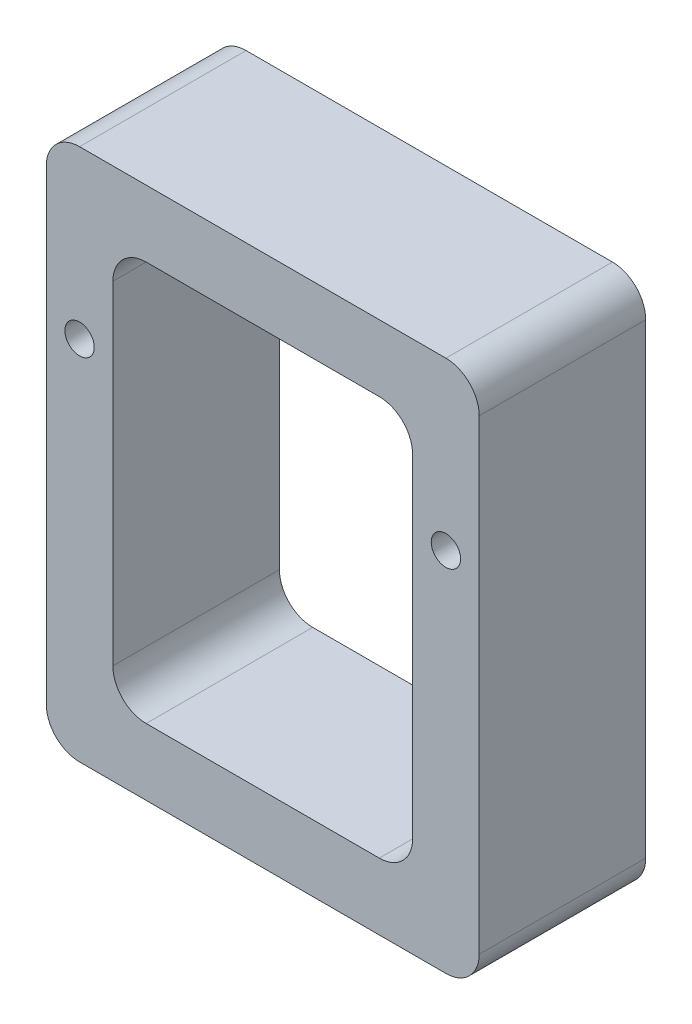
ISO-10303-21;
HEADER;
FILE_DESCRIPTION(('STEP AP214'),'2;1');
FILE_NAME('part.step','',(''),(''),'','','');
FILE_SCHEMA(('AUTOMOTIVE_DESIGN { 1 0 10303 214 1 1 1 1 }'));
ENDSEC;
DATA;
#1=APPLICATION_CONTEXT('core data for automotive mechanical design processes');
#2=APPLICATION_PROTOCOL_DEFINITION('international standard','automotive_design',2000,#1);
#3=PRODUCT_CONTEXT('',#1,'mechanical');
#4=PRODUCT('Part','Part','',(#3));
#5=PRODUCT_RELATED_PRODUCT_CATEGORY('part','',(#4));
#6=PRODUCT_DEFINITION_FORMATION('','',#4);
#7=PRODUCT_DEFINITION_CONTEXT('part definition',#1,'design');
#8=PRODUCT_DEFINITION('design','',#6,#7);
#9=PRODUCT_DEFINITION_SHAPE('','',#8);
#10=(LENGTH_UNIT() NAMED_UNIT(*) SI_UNIT(.MILLI.,.METRE.));
#11=(NAMED_UNIT(*) PLANE_ANGLE_UNIT() SI_UNIT($,.RADIAN.));
#12=(NAMED_UNIT(*) SI_UNIT($,.STERADIAN.) SOLID_ANGLE_UNIT());
#13=UNCERTAINTY_MEASURE_WITH_UNIT(LENGTH_MEASURE(1.E-05),#10,'distance_accuracy_value','');
#14=(GEOMETRIC_REPRESENTATION_CONTEXT(3) GLOBAL_UNCERTAINTY_ASSIGNED_CONTEXT((#13)) GLOBAL_UNIT_ASSIGNED_CONTEXT((#10,
#11,#12)) REPRESENTATION_CONTEXT('',''));
#15=CARTESIAN_POINT('',(0.,0.,0.));
#16=DIRECTION('',(0.,0.,1.));
#17=DIRECTION('',(1.,0.,0.));
#18=AXIS2_PLACEMENT_3D('',#15,#16,#17);
#19=CARTESIAN_POINT('',(-139.7,-177.8,127.));
#20=DIRECTION('',(0.,0.,-1.));
#21=DIRECTION('',(-1.,0.,0.));
#22=AXIS2_PLACEMENT_3D('',#19,#20,#21);
#23=PLANE('',#22);
#24=CARTESIAN_POINT('',(-139.7,-177.8,127.));
#25=DIRECTION('',(0.,0.,1.));
#26=DIRECTION('',(-1.,0.,0.));
#27=AXIS2_PLACEMENT_3D('',#24,#25,#26);
#28=CIRCLE('',#27,25.4);
#29=CARTESIAN_POINT('',(-165.1,-177.8,127.));
#30=VERTEX_POINT('',#29);
#31=CARTESIAN_POINT('',(-139.7,-203.2,127.));
#32=VERTEX_POINT('',#31);
#33=EDGE_CURVE('E222',#30,#32,#28,.T.);
#34=ORIENTED_EDGE('',*,*,#33,.T.);
#35=DIRECTION('',(1.,0.,0.));
#36=VECTOR('',#35,1.);
#37=CARTESIAN_POINT('',(-139.7,-203.2,127.));
#38=LINE('',#37,#36);
#39=CARTESIAN_POINT('',(139.7,-203.2,127.));
#40=VERTEX_POINT('',#39);
#41=EDGE_CURVE('E225',#32,#40,#38,.T.);
#42=ORIENTED_EDGE('',*,*,#41,.T.);
#43=CARTESIAN_POINT('',(139.7,-177.8,127.));
#44=DIRECTION('',(0.,0.,1.));
#45=DIRECTION('',(1.,0.,0.));
#46=AXIS2_PLACEMENT_3D('',#43,#44,#45);
#47=CIRCLE('',#46,25.4);
#48=CARTESIAN_POINT('',(165.1,-177.8,127.));
#49=VERTEX_POINT('',#48);
#50=EDGE_CURVE('E228',#40,#49,#47,.T.);
#51=ORIENTED_EDGE('',*,*,#50,.T.);
#52=DIRECTION('',(0.,1.,0.));
#53=VECTOR('',#52,1.);
#54=CARTESIAN_POINT('',(165.1,-177.8,127.));
#55=LINE('',#54,#53);
#56=CARTESIAN_POINT('',(165.1,177.8,127.));
#57=VERTEX_POINT('',#56);
#58=EDGE_CURVE('E230',#49,#57,#55,.T.);
#59=ORIENTED_EDGE('',*,*,#58,.T.);
#60=CARTESIAN_POINT('',(139.7,177.8,127.));
#61=DIRECTION('',(0.,0.,1.));
#62=DIRECTION('',(-1.,0.,0.));
#63=AXIS2_PLACEMENT_3D('',#60,#61,#62);
#64=CIRCLE('',#63,25.4);
#65=CARTESIAN_POINT('',(139.7,203.2,127.));
#66=VERTEX_POINT('',#65);
#67=EDGE_CURVE('E232',#57,#66,#64,.T.);
#68=ORIENTED_EDGE('',*,*,#67,.T.);
#69=DIRECTION('',(-1.,0.,0.));
#70=VECTOR('',#69,1.);
#71=CARTESIAN_POINT('',(-139.7,203.2,127.));
#72=LINE('',#71,#70);
#73=CARTESIAN_POINT('',(-139.7,203.2,127.));
#74=VERTEX_POINT('',#73);
#75=EDGE_CURVE('E234',#66,#74,#72,.T.);
#76=ORIENTED_EDGE('',*,*,#75,.T.);
#77=CARTESIAN_POINT('',(-139.7,177.8,127.));
#78=DIRECTION('',(0.,0.,1.));
#79=DIRECTION('',(-1.,0.,0.));
#80=AXIS2_PLACEMENT_3D('',#77,#78,#79);
#81=CIRCLE('',#80,25.4);
#82=CARTESIAN_POINT('',(-165.1,177.8,127.));
#83=VERTEX_POINT('',#82);
#84=EDGE_CURVE('E236',#74,#83,#81,.T.);
#85=ORIENTED_EDGE('',*,*,#84,.T.);
#86=DIRECTION('',(0.,-1.,0.));
#87=VECTOR('',#86,1.);
#88=CARTESIAN_POINT('',(-165.1,-177.8,127.));
#89=LINE('',#88,#87);
#90=EDGE_CURVE('E238',#83,#30,#89,.T.);
#91=ORIENTED_EDGE('',*,*,#90,.T.);
#92=EDGE_LOOP('',(#34,#42,#51,#59,#68,#76,#85,#91));
#93=FACE_BOUND('',#92,.T.);
#94=CARTESIAN_POINT('',(88.9,-127.,127.));
#95=DIRECTION('',(0.,0.,1.));
#96=DIRECTION('',(-1.,0.,0.));
#97=AXIS2_PLACEMENT_3D('',#94,#95,#96);
#98=CIRCLE('',#97,25.4000000000001);
#99=CARTESIAN_POINT('',(88.9,-152.4,127.));
#100=VERTEX_POINT('',#99);
#101=CARTESIAN_POINT('',(114.3,-127.,127.));
#102=VERTEX_POINT('',#101);
#103=EDGE_CURVE('E154',#100,#102,#98,.T.);
#104=ORIENTED_EDGE('',*,*,#103,.F.);
#105=DIRECTION('',(1.,0.,0.));
#106=VECTOR('',#105,1.);
#107=CARTESIAN_POINT('',(-88.9,-152.4,127.));
#108=LINE('',#107,#106);
#109=CARTESIAN_POINT('',(-88.9,-152.4,127.));
#110=VERTEX_POINT('',#109);
#111=EDGE_CURVE('E189',#110,#100,#108,.T.);
#112=ORIENTED_EDGE('',*,*,#111,.F.);
#113=CARTESIAN_POINT('',(-88.9,-127.,127.));
#114=DIRECTION('',(0.,0.,1.));
#115=DIRECTION('',(1.,0.,0.));
#116=AXIS2_PLACEMENT_3D('',#113,#114,#115);
#117=CIRCLE('',#116,25.4000000000001);
#118=CARTESIAN_POINT('',(-114.3,-127.,127.));
#119=VERTEX_POINT('',#118);
#120=EDGE_CURVE('E187',#119,#110,#117,.T.);
#121=ORIENTED_EDGE('',*,*,#120,.F.);
#122=DIRECTION('',(0.,-1.,0.));
#123=VECTOR('',#122,1.);
#124=CARTESIAN_POINT('',(-114.3,-127.,127.));
#125=LINE('',#124,#123);
#126=CARTESIAN_POINT('',(-114.3,127.,127.));
#127=VERTEX_POINT('',#126);
#128=EDGE_CURVE('E185',#127,#119,#125,.T.);
#129=ORIENTED_EDGE('',*,*,#128,.F.);
#130=CARTESIAN_POINT('',(-88.9,127.,127.));
#131=DIRECTION('',(0.,0.,1.));
#132=DIRECTION('',(-1.,0.,0.));
#133=AXIS2_PLACEMENT_3D('',#130,#131,#132);
#134=CIRCLE('',#133,25.4);
#135=CARTESIAN_POINT('',(-88.9,152.4,127.));
#136=VERTEX_POINT('',#135);
#137=EDGE_CURVE('E183',#136,#127,#134,.T.);
#138=ORIENTED_EDGE('',*,*,#137,.F.);
#139=DIRECTION('',(-1.,0.,0.));
#140=VECTOR('',#139,1.);
#141=CARTESIAN_POINT('',(-88.9,152.4,127.));
#142=LINE('',#141,#140);
#143=CARTESIAN_POINT('',(88.9,152.4,127.));
#144=VERTEX_POINT('',#143);
#145=EDGE_CURVE('E178',#144,#136,#142,.T.);
#146=ORIENTED_EDGE('',*,*,#145,.F.);
#147=CARTESIAN_POINT('',(88.9,127.,127.));
#148=DIRECTION('',(0.,0.,1.));
#149=DIRECTION('',(-1.,0.,0.));
#150=AXIS2_PLACEMENT_3D('',#147,#148,#149);
#151=CIRCLE('',#150,25.4);
#152=CARTESIAN_POINT('',(114.3,127.,127.));
#153=VERTEX_POINT('',#152);
#154=EDGE_CURVE('E176',#153,#144,#151,.T.);
#155=ORIENTED_EDGE('',*,*,#154,.F.);
#156=DIRECTION('',(0.,1.,0.));
#157=VECTOR('',#156,1.);
#158=CARTESIAN_POINT('',(114.3,-127.,127.));
#159=LINE('',#158,#157);
#160=EDGE_CURVE('E162',#102,#153,#159,.T.);
#161=ORIENTED_EDGE('',*,*,#160,.F.);
#162=EDGE_LOOP('',(#104,#112,#121,#129,#138,#146,#155,#161));
#163=FACE_BOUND('',#162,.T.);
#164=CARTESIAN_POINT('',(-139.7,76.2,127.));
#165=DIRECTION('',(0.,0.,1.));
#166=DIRECTION('',(1.,0.,0.));
#167=AXIS2_PLACEMENT_3D('',#164,#165,#166);
#168=CIRCLE('',#167,11.2);
#169=CARTESIAN_POINT('',(-128.5,76.2,127.));
#170=VERTEX_POINT('',#169);
#171=EDGE_CURVE('E192',#170,#170,#168,.T.);
#172=ORIENTED_EDGE('',*,*,#171,.F.);
#173=EDGE_LOOP('',(#172));
#174=FACE_BOUND('',#173,.T.);
#175=CARTESIAN_POINT('',(139.7,76.2,127.));
#176=DIRECTION('',(0.,0.,1.));
#177=DIRECTION('',(-1.,0.,0.));
#178=AXIS2_PLACEMENT_3D('',#175,#176,#177);
#179=CIRCLE('',#178,11.2);
#180=CARTESIAN_POINT('',(128.5,76.2,127.));
#181=VERTEX_POINT('',#180);
#182=EDGE_CURVE('E377',#181,#181,#179,.T.);
#183=ORIENTED_EDGE('',*,*,#182,.F.);
#184=EDGE_LOOP('',(#183));
#185=FACE_BOUND('',#184,.T.);
#186=ADVANCED_FACE('F41',(#93,#163,#174,#185),#23,.F.);
#187=CARTESIAN_POINT('',(-139.7,-177.8,0.));
#188=DIRECTION('',(0.,0.,-1.));
#189=DIRECTION('',(-1.,0.,0.));
#190=AXIS2_PLACEMENT_3D('',#187,#188,#189);
#191=PLANE('',#190);
#192=CARTESIAN_POINT('',(-139.7,76.2,0.));
#193=DIRECTION('',(0.,0.,1.));
#194=DIRECTION('',(1.,0.,0.));
#195=AXIS2_PLACEMENT_3D('',#192,#193,#194);
#196=CIRCLE('',#195,11.2);
#197=CARTESIAN_POINT('',(-128.5,76.2,0.));
#198=VERTEX_POINT('',#197);
#199=EDGE_CURVE('E383',#198,#198,#196,.T.);
#200=ORIENTED_EDGE('',*,*,#199,.T.);
#201=EDGE_LOOP('',(#200));
#202=FACE_BOUND('',#201,.T.);
#203=CARTESIAN_POINT('',(-139.7,-177.8,0.));
#204=DIRECTION('',(0.,0.,1.));
#205=DIRECTION('',(-1.,0.,0.));
#206=AXIS2_PLACEMENT_3D('',#203,#204,#205);
#207=CIRCLE('',#206,25.4);
#208=CARTESIAN_POINT('',(-165.1,-177.8,0.));
#209=VERTEX_POINT('',#208);
#210=CARTESIAN_POINT('',(-139.7,-203.2,0.));
#211=VERTEX_POINT('',#210);
#212=EDGE_CURVE('E170',#209,#211,#207,.T.);
#213=ORIENTED_EDGE('',*,*,#212,.F.);
#214=DIRECTION('',(0.,-1.,0.));
#215=VECTOR('',#214,1.);
#216=CARTESIAN_POINT('',(-165.1,-177.8,0.));
#217=LINE('',#216,#215);
#218=CARTESIAN_POINT('',(-165.1,177.8,0.));
#219=VERTEX_POINT('',#218);
#220=EDGE_CURVE('E226',#219,#209,#217,.T.);
#221=ORIENTED_EDGE('',*,*,#220,.F.);
#222=CARTESIAN_POINT('',(-139.7,177.8,0.));
#223=DIRECTION('',(0.,0.,1.));
#224=DIRECTION('',(-1.,0.,0.));
#225=AXIS2_PLACEMENT_3D('',#222,#223,#224);
#226=CIRCLE('',#225,25.4);
#227=CARTESIAN_POINT('',(-139.7,203.2,0.));
#228=VERTEX_POINT('',#227);
#229=EDGE_CURVE('E253',#228,#219,#226,.T.);
#230=ORIENTED_EDGE('',*,*,#229,.F.);
#231=DIRECTION('',(-1.,0.,0.));
#232=VECTOR('',#231,1.);
#233=CARTESIAN_POINT('',(-139.7,203.2,0.));
#234=LINE('',#233,#232);
#235=CARTESIAN_POINT('',(139.7,203.2,0.));
#236=VERTEX_POINT('',#235);
#237=EDGE_CURVE('E251',#236,#228,#234,.T.);
#238=ORIENTED_EDGE('',*,*,#237,.F.);
#239=CARTESIAN_POINT('',(139.7,177.8,0.));
#240=DIRECTION('',(0.,0.,1.));
#241=DIRECTION('',(-1.,0.,0.));
#242=AXIS2_PLACEMENT_3D('',#239,#240,#241);
#243=CIRCLE('',#242,25.4);
#244=CARTESIAN_POINT('',(165.1,177.8,0.));
#245=VERTEX_POINT('',#244);
#246=EDGE_CURVE('E249',#245,#236,#243,.T.);
#247=ORIENTED_EDGE('',*,*,#246,.F.);
#248=DIRECTION('',(0.,1.,0.));
#249=VECTOR('',#248,1.);
#250=CARTESIAN_POINT('',(165.1,-177.8,0.));
#251=LINE('',#250,#249);
#252=CARTESIAN_POINT('',(165.1,-177.8,0.));
#253=VERTEX_POINT('',#252);
#254=EDGE_CURVE('E247',#253,#245,#251,.T.);
#255=ORIENTED_EDGE('',*,*,#254,.F.);
#256=CARTESIAN_POINT('',(139.7,-177.8,0.));
#257=DIRECTION('',(0.,0.,1.));
#258=DIRECTION('',(1.,0.,0.));
#259=AXIS2_PLACEMENT_3D('',#256,#257,#258);
#260=CIRCLE('',#259,25.4);
#261=CARTESIAN_POINT('',(139.7,-203.2,0.));
#262=VERTEX_POINT('',#261);
#263=EDGE_CURVE('E245',#262,#253,#260,.T.);
#264=ORIENTED_EDGE('',*,*,#263,.F.);
#265=DIRECTION('',(1.,0.,0.));
#266=VECTOR('',#265,1.);
#267=CARTESIAN_POINT('',(-139.7,-203.2,0.));
#268=LINE('',#267,#266);
#269=EDGE_CURVE('E243',#211,#262,#268,.T.);
#270=ORIENTED_EDGE('',*,*,#269,.F.);
#271=EDGE_LOOP('',(#213,#221,#230,#238,#247,#255,#264,#270));
#272=FACE_BOUND('',#271,.T.);
#273=DIRECTION('',(1.,0.,0.));
#274=VECTOR('',#273,1.);
#275=CARTESIAN_POINT('',(-88.9,-152.4,0.));
#276=LINE('',#275,#274);
#277=CARTESIAN_POINT('',(-88.9,-152.4,0.));
#278=VERTEX_POINT('',#277);
#279=CARTESIAN_POINT('',(88.9,-152.4,0.));
#280=VERTEX_POINT('',#279);
#281=EDGE_CURVE('E163',#278,#280,#276,.T.);
#282=ORIENTED_EDGE('',*,*,#281,.T.);
#283=CARTESIAN_POINT('',(88.9,-127.,0.));
#284=DIRECTION('',(0.,0.,1.));
#285=DIRECTION('',(-1.,0.,0.));
#286=AXIS2_PLACEMENT_3D('',#283,#284,#285);
#287=CIRCLE('',#286,25.4000000000001);
#288=CARTESIAN_POINT('',(114.3,-127.,0.));
#289=VERTEX_POINT('',#288);
#290=EDGE_CURVE('E64',#280,#289,#287,.T.);
#291=ORIENTED_EDGE('',*,*,#290,.T.);
#292=DIRECTION('',(0.,1.,0.));
#293=VECTOR('',#292,1.);
#294=CARTESIAN_POINT('',(114.3,-127.,0.));
#295=LINE('',#294,#293);
#296=CARTESIAN_POINT('',(114.3,127.,0.));
#297=VERTEX_POINT('',#296);
#298=EDGE_CURVE('E169',#289,#297,#295,.T.);
#299=ORIENTED_EDGE('',*,*,#298,.T.);
#300=CARTESIAN_POINT('',(88.9,127.,0.));
#301=DIRECTION('',(0.,0.,1.));
#302=DIRECTION('',(-1.,0.,0.));
#303=AXIS2_PLACEMENT_3D('',#300,#301,#302);
#304=CIRCLE('',#303,25.4);
#305=CARTESIAN_POINT('',(88.9,152.4,0.));
#306=VERTEX_POINT('',#305);
#307=EDGE_CURVE('E194',#297,#306,#304,.T.);
#308=ORIENTED_EDGE('',*,*,#307,.T.);
#309=DIRECTION('',(-1.,0.,0.));
#310=VECTOR('',#309,1.);
#311=CARTESIAN_POINT('',(-88.9,152.4,0.));
#312=LINE('',#311,#310);
#313=CARTESIAN_POINT('',(-88.9,152.4,0.));
#314=VERTEX_POINT('',#313);
#315=EDGE_CURVE('E197',#306,#314,#312,.T.);
#316=ORIENTED_EDGE('',*,*,#315,.T.);
#317=CARTESIAN_POINT('',(-88.9,127.,0.));
#318=DIRECTION('',(0.,0.,1.));
#319=DIRECTION('',(-1.,0.,0.));
#320=AXIS2_PLACEMENT_3D('',#317,#318,#319);
#321=CIRCLE('',#320,25.4);
#322=CARTESIAN_POINT('',(-114.3,127.,0.));
#323=VERTEX_POINT('',#322);
#324=EDGE_CURVE('E200',#314,#323,#321,.T.);
#325=ORIENTED_EDGE('',*,*,#324,.T.);
#326=DIRECTION('',(0.,-1.,0.));
#327=VECTOR('',#326,1.);
#328=CARTESIAN_POINT('',(-114.3,-127.,0.));
#329=LINE('',#328,#327);
#330=CARTESIAN_POINT('',(-114.3,-127.,0.));
#331=VERTEX_POINT('',#330);
#332=EDGE_CURVE('E203',#323,#331,#329,.T.);
#333=ORIENTED_EDGE('',*,*,#332,.T.);
#334=CARTESIAN_POINT('',(-88.9,-127.,0.));
#335=DIRECTION('',(0.,0.,1.));
#336=DIRECTION('',(1.,0.,0.));
#337=AXIS2_PLACEMENT_3D('',#334,#335,#336);
#338=CIRCLE('',#337,25.4000000000001);
#339=EDGE_CURVE('E206',#331,#278,#338,.T.);
#340=ORIENTED_EDGE('',*,*,#339,.T.);
#341=EDGE_LOOP('',(#282,#291,#299,#308,#316,#325,#333,#340));
#342=FACE_BOUND('',#341,.T.);
#343=CARTESIAN_POINT('',(139.7,76.2,0.));
#344=DIRECTION('',(0.,0.,1.));
#345=DIRECTION('',(-1.,0.,0.));
#346=AXIS2_PLACEMENT_3D('',#343,#344,#345);
#347=CIRCLE('',#346,11.2);
#348=CARTESIAN_POINT('',(128.5,76.2,0.));
#349=VERTEX_POINT('',#348);
#350=EDGE_CURVE('E380',#349,#349,#347,.T.);
#351=ORIENTED_EDGE('',*,*,#350,.T.);
#352=EDGE_LOOP('',(#351));
#353=FACE_BOUND('',#352,.T.);
#354=ADVANCED_FACE('F283',(#202,#272,#342,#353),#191,.T.);
#355=CARTESIAN_POINT('',(-139.7,-177.8,127.));
#356=DIRECTION('',(0.,0.,-1.));
#357=DIRECTION('',(-1.,0.,0.));
#358=AXIS2_PLACEMENT_3D('',#355,#356,#357);
#359=CYLINDRICAL_SURFACE('',#358,25.4);
#360=ORIENTED_EDGE('',*,*,#212,.T.);
#361=DIRECTION('',(0.,0.,-1.));
#362=VECTOR('',#361,1.);
#363=CARTESIAN_POINT('',(-139.7,-203.2,127.));
#364=LINE('',#363,#362);
#365=EDGE_CURVE('E11',#32,#211,#364,.T.);
#366=ORIENTED_EDGE('',*,*,#365,.F.);
#367=ORIENTED_EDGE('',*,*,#33,.F.);
#368=DIRECTION('',(0.,0.,-1.));
#369=VECTOR('',#368,1.);
#370=CARTESIAN_POINT('',(-165.1,-177.8,127.));
#371=LINE('',#370,#369);
#372=EDGE_CURVE('E240',#30,#209,#371,.T.);
#373=ORIENTED_EDGE('',*,*,#372,.T.);
#374=EDGE_LOOP('',(#360,#366,#367,#373));
#375=FACE_BOUND('',#374,.T.);
#376=ADVANCED_FACE('F43',(#375),#359,.T.);
#377=CARTESIAN_POINT('',(-139.7,-203.2,127.));
#378=DIRECTION('',(0.,1.,0.));
#379=DIRECTION('',(0.,0.,1.));
#380=AXIS2_PLACEMENT_3D('',#377,#378,#379);
#381=PLANE('',#380);
#382=ORIENTED_EDGE('',*,*,#269,.T.);
#383=DIRECTION('',(0.,0.,-1.));
#384=VECTOR('',#383,1.);
#385=CARTESIAN_POINT('',(139.7,-203.2,127.));
#386=LINE('',#385,#384);
#387=EDGE_CURVE('E49',#40,#262,#386,.T.);
#388=ORIENTED_EDGE('',*,*,#387,.F.);
#389=ORIENTED_EDGE('',*,*,#41,.F.);
#390=ORIENTED_EDGE('',*,*,#365,.T.);
#391=EDGE_LOOP('',(#382,#388,#389,#390));
#392=FACE_BOUND('',#391,.T.);
#393=ADVANCED_FACE('F300',(#392),#381,.F.);
#394=CARTESIAN_POINT('',(139.7,-177.8,127.));
#395=DIRECTION('',(0.,0.,-1.));
#396=DIRECTION('',(-1.,0.,0.));
#397=AXIS2_PLACEMENT_3D('',#394,#395,#396);
#398=CYLINDRICAL_SURFACE('',#397,25.4);
#399=ORIENTED_EDGE('',*,*,#263,.T.);
#400=DIRECTION('',(0.,0.,-1.));
#401=VECTOR('',#400,1.);
#402=CARTESIAN_POINT('',(165.1,-177.8,127.));
#403=LINE('',#402,#401);
#404=EDGE_CURVE('E270',#49,#253,#403,.T.);
#405=ORIENTED_EDGE('',*,*,#404,.F.);
#406=ORIENTED_EDGE('',*,*,#50,.F.);
#407=ORIENTED_EDGE('',*,*,#387,.T.);
#408=EDGE_LOOP('',(#399,#405,#406,#407));
#409=FACE_BOUND('',#408,.T.);
#410=ADVANCED_FACE('F277',(#409),#398,.T.);
#411=CARTESIAN_POINT('',(165.1,-177.8,127.));
#412=DIRECTION('',(-1.,0.,0.));
#413=DIRECTION('',(0.,0.,1.));
#414=AXIS2_PLACEMENT_3D('',#411,#412,#413);
#415=PLANE('',#414);
#416=ORIENTED_EDGE('',*,*,#254,.T.);
#417=DIRECTION('',(0.,0.,-1.));
#418=VECTOR('',#417,1.);
#419=CARTESIAN_POINT('',(165.1,177.8,127.));
#420=LINE('',#419,#418);
#421=EDGE_CURVE('E267',#57,#245,#420,.T.);
#422=ORIENTED_EDGE('',*,*,#421,.F.);
#423=ORIENTED_EDGE('',*,*,#58,.F.);
#424=ORIENTED_EDGE('',*,*,#404,.T.);
#425=EDGE_LOOP('',(#416,#422,#423,#424));
#426=FACE_BOUND('',#425,.T.);
#427=ADVANCED_FACE('F289',(#426),#415,.F.);
#428=CARTESIAN_POINT('',(139.7,177.8,127.));
#429=DIRECTION('',(0.,0.,-1.));
#430=DIRECTION('',(-1.,0.,0.));
#431=AXIS2_PLACEMENT_3D('',#428,#429,#430);
#432=CYLINDRICAL_SURFACE('',#431,25.4);
#433=ORIENTED_EDGE('',*,*,#246,.T.);
#434=DIRECTION('',(0.,0.,-1.));
#435=VECTOR('',#434,1.);
#436=CARTESIAN_POINT('',(139.7,203.2,127.));
#437=LINE('',#436,#435);
#438=EDGE_CURVE('E264',#66,#236,#437,.T.);
#439=ORIENTED_EDGE('',*,*,#438,.F.);
#440=ORIENTED_EDGE('',*,*,#67,.F.);
#441=ORIENTED_EDGE('',*,*,#421,.T.);
#442=EDGE_LOOP('',(#433,#439,#440,#441));
#443=FACE_BOUND('',#442,.T.);
#444=ADVANCED_FACE('F293',(#443),#432,.T.);
#445=CARTESIAN_POINT('',(-139.7,203.2,127.));
#446=DIRECTION('',(0.,-1.,0.));
#447=DIRECTION('',(0.,0.,-1.));
#448=AXIS2_PLACEMENT_3D('',#445,#446,#447);
#449=PLANE('',#448);
#450=ORIENTED_EDGE('',*,*,#237,.T.);
#451=DIRECTION('',(0.,0.,-1.));
#452=VECTOR('',#451,1.);
#453=CARTESIAN_POINT('',(-139.7,203.2,127.));
#454=LINE('',#453,#452);
#455=EDGE_CURVE('E261',#74,#228,#454,.T.);
#456=ORIENTED_EDGE('',*,*,#455,.F.);
#457=ORIENTED_EDGE('',*,*,#75,.F.);
#458=ORIENTED_EDGE('',*,*,#438,.T.);
#459=EDGE_LOOP('',(#450,#456,#457,#458));
#460=FACE_BOUND('',#459,.T.);
#461=ADVANCED_FACE('F313',(#460),#449,.F.);
#462=CARTESIAN_POINT('',(-139.7,177.8,127.));
#463=DIRECTION('',(0.,0.,-1.));
#464=DIRECTION('',(-1.,0.,0.));
#465=AXIS2_PLACEMENT_3D('',#462,#463,#464);
#466=CYLINDRICAL_SURFACE('',#465,25.4);
#467=ORIENTED_EDGE('',*,*,#229,.T.);
#468=DIRECTION('',(0.,0.,-1.));
#469=VECTOR('',#468,1.);
#470=CARTESIAN_POINT('',(-165.1,177.8,127.));
#471=LINE('',#470,#469);
#472=EDGE_CURVE('E258',#83,#219,#471,.T.);
#473=ORIENTED_EDGE('',*,*,#472,.F.);
#474=ORIENTED_EDGE('',*,*,#84,.F.);
#475=ORIENTED_EDGE('',*,*,#455,.T.);
#476=EDGE_LOOP('',(#467,#473,#474,#475));
#477=FACE_BOUND('',#476,.T.);
#478=ADVANCED_FACE('F311',(#477),#466,.T.);
#479=CARTESIAN_POINT('',(-165.1,-177.8,127.));
#480=DIRECTION('',(1.,0.,0.));
#481=DIRECTION('',(0.,0.,-1.));
#482=AXIS2_PLACEMENT_3D('',#479,#480,#481);
#483=PLANE('',#482);
#484=ORIENTED_EDGE('',*,*,#220,.T.);
#485=ORIENTED_EDGE('',*,*,#372,.F.);
#486=ORIENTED_EDGE('',*,*,#90,.F.);
#487=ORIENTED_EDGE('',*,*,#472,.T.);
#488=EDGE_LOOP('',(#484,#485,#486,#487));
#489=FACE_BOUND('',#488,.T.);
#490=ADVANCED_FACE('F306',(#489),#483,.F.);
#491=CARTESIAN_POINT('',(88.9,-127.,127.));
#492=DIRECTION('',(0.,0.,-1.));
#493=DIRECTION('',(-1.,0.,0.));
#494=AXIS2_PLACEMENT_3D('',#491,#492,#493);
#495=CYLINDRICAL_SURFACE('',#494,25.4000000000001);
#496=ORIENTED_EDGE('',*,*,#290,.F.);
#497=DIRECTION('',(0.,0.,-1.));
#498=VECTOR('',#497,1.);
#499=CARTESIAN_POINT('',(88.9,-152.4,127.));
#500=LINE('',#499,#498);
#501=EDGE_CURVE('E158',#100,#280,#500,.T.);
#502=ORIENTED_EDGE('',*,*,#501,.F.);
#503=ORIENTED_EDGE('',*,*,#103,.T.);
#504=DIRECTION('',(0.,0.,-1.));
#505=VECTOR('',#504,1.);
#506=CARTESIAN_POINT('',(114.3,-127.,127.));
#507=LINE('',#506,#505);
#508=EDGE_CURVE('E157',#102,#289,#507,.T.);
#509=ORIENTED_EDGE('',*,*,#508,.T.);
#510=EDGE_LOOP('',(#496,#502,#503,#509));
#511=FACE_BOUND('',#510,.T.);
#512=ADVANCED_FACE('F156',(#511),#495,.F.);
#513=CARTESIAN_POINT('',(114.3,-127.,127.));
#514=DIRECTION('',(-1.,0.,0.));
#515=DIRECTION('',(0.,0.,1.));
#516=AXIS2_PLACEMENT_3D('',#513,#514,#515);
#517=PLANE('',#516);
#518=ORIENTED_EDGE('',*,*,#298,.F.);
#519=ORIENTED_EDGE('',*,*,#508,.F.);
#520=ORIENTED_EDGE('',*,*,#160,.T.);
#521=DIRECTION('',(0.,0.,-1.));
#522=VECTOR('',#521,1.);
#523=CARTESIAN_POINT('',(114.3,127.,127.));
#524=LINE('',#523,#522);
#525=EDGE_CURVE('E171',#153,#297,#524,.T.);
#526=ORIENTED_EDGE('',*,*,#525,.T.);
#527=EDGE_LOOP('',(#518,#519,#520,#526));
#528=FACE_BOUND('',#527,.T.);
#529=ADVANCED_FACE('F166',(#528),#517,.T.);
#530=CARTESIAN_POINT('',(88.9,127.,127.));
#531=DIRECTION('',(0.,0.,-1.));
#532=DIRECTION('',(-1.,0.,0.));
#533=AXIS2_PLACEMENT_3D('',#530,#531,#532);
#534=CYLINDRICAL_SURFACE('',#533,25.4);
#535=ORIENTED_EDGE('',*,*,#307,.F.);
#536=ORIENTED_EDGE('',*,*,#525,.F.);
#537=ORIENTED_EDGE('',*,*,#154,.T.);
#538=DIRECTION('',(0.,0.,-1.));
#539=VECTOR('',#538,1.);
#540=CARTESIAN_POINT('',(88.9,152.4,127.));
#541=LINE('',#540,#539);
#542=EDGE_CURVE('E219',#144,#306,#541,.T.);
#543=ORIENTED_EDGE('',*,*,#542,.T.);
#544=EDGE_LOOP('',(#535,#536,#537,#543));
#545=FACE_BOUND('',#544,.T.);
#546=ADVANCED_FACE('F339',(#545),#534,.F.);
#547=CARTESIAN_POINT('',(-88.9,152.4,127.));
#548=DIRECTION('',(0.,-1.,0.));
#549=DIRECTION('',(0.,0.,-1.));
#550=AXIS2_PLACEMENT_3D('',#547,#548,#549);
#551=PLANE('',#550);
#552=ORIENTED_EDGE('',*,*,#315,.F.);
#553=ORIENTED_EDGE('',*,*,#542,.F.);
#554=ORIENTED_EDGE('',*,*,#145,.T.);
#555=DIRECTION('',(0.,0.,-1.));
#556=VECTOR('',#555,1.);
#557=CARTESIAN_POINT('',(-88.9,152.4,127.));
#558=LINE('',#557,#556);
#559=EDGE_CURVE('E217',#136,#314,#558,.T.);
#560=ORIENTED_EDGE('',*,*,#559,.T.);
#561=EDGE_LOOP('',(#552,#553,#554,#560));
#562=FACE_BOUND('',#561,.T.);
#563=ADVANCED_FACE('F343',(#562),#551,.T.);
#564=CARTESIAN_POINT('',(-88.9,127.,127.));
#565=DIRECTION('',(0.,0.,-1.));
#566=DIRECTION('',(-1.,0.,0.));
#567=AXIS2_PLACEMENT_3D('',#564,#565,#566);
#568=CYLINDRICAL_SURFACE('',#567,25.4);
#569=ORIENTED_EDGE('',*,*,#324,.F.);
#570=ORIENTED_EDGE('',*,*,#559,.F.);
#571=ORIENTED_EDGE('',*,*,#137,.T.);
#572=DIRECTION('',(0.,0.,-1.));
#573=VECTOR('',#572,1.);
#574=CARTESIAN_POINT('',(-114.3,127.,127.));
#575=LINE('',#574,#573);
#576=EDGE_CURVE('E215',#127,#323,#575,.T.);
#577=ORIENTED_EDGE('',*,*,#576,.T.);
#578=EDGE_LOOP('',(#569,#570,#571,#577));
#579=FACE_BOUND('',#578,.T.);
#580=ADVANCED_FACE('F349',(#579),#568,.F.);
#581=CARTESIAN_POINT('',(-114.3,-127.,127.));
#582=DIRECTION('',(1.,0.,0.));
#583=DIRECTION('',(0.,0.,-1.));
#584=AXIS2_PLACEMENT_3D('',#581,#582,#583);
#585=PLANE('',#584);
#586=ORIENTED_EDGE('',*,*,#332,.F.);
#587=ORIENTED_EDGE('',*,*,#576,.F.);
#588=ORIENTED_EDGE('',*,*,#128,.T.);
#589=DIRECTION('',(0.,0.,-1.));
#590=VECTOR('',#589,1.);
#591=CARTESIAN_POINT('',(-114.3,-127.,127.));
#592=LINE('',#591,#590);
#593=EDGE_CURVE('E213',#119,#331,#592,.T.);
#594=ORIENTED_EDGE('',*,*,#593,.T.);
#595=EDGE_LOOP('',(#586,#587,#588,#594));
#596=FACE_BOUND('',#595,.T.);
#597=ADVANCED_FACE('F353',(#596),#585,.T.);
#598=CARTESIAN_POINT('',(-88.9,-127.,127.));
#599=DIRECTION('',(0.,0.,-1.));
#600=DIRECTION('',(-1.,0.,0.));
#601=AXIS2_PLACEMENT_3D('',#598,#599,#600);
#602=CYLINDRICAL_SURFACE('',#601,25.4000000000001);
#603=ORIENTED_EDGE('',*,*,#339,.F.);
#604=ORIENTED_EDGE('',*,*,#593,.F.);
#605=ORIENTED_EDGE('',*,*,#120,.T.);
#606=DIRECTION('',(0.,0.,-1.));
#607=VECTOR('',#606,1.);
#608=CARTESIAN_POINT('',(-88.9,-152.4,127.));
#609=LINE('',#608,#607);
#610=EDGE_CURVE('E56',#110,#278,#609,.T.);
#611=ORIENTED_EDGE('',*,*,#610,.T.);
#612=EDGE_LOOP('',(#603,#604,#605,#611));
#613=FACE_BOUND('',#612,.T.);
#614=ADVANCED_FACE('F357',(#613),#602,.F.);
#615=CARTESIAN_POINT('',(-88.9,-152.4,127.));
#616=DIRECTION('',(0.,1.,0.));
#617=DIRECTION('',(0.,0.,1.));
#618=AXIS2_PLACEMENT_3D('',#615,#616,#617);
#619=PLANE('',#618);
#620=ORIENTED_EDGE('',*,*,#281,.F.);
#621=ORIENTED_EDGE('',*,*,#610,.F.);
#622=ORIENTED_EDGE('',*,*,#111,.T.);
#623=ORIENTED_EDGE('',*,*,#501,.T.);
#624=EDGE_LOOP('',(#620,#621,#622,#623));
#625=FACE_BOUND('',#624,.T.);
#626=ADVANCED_FACE('F361',(#625),#619,.T.);
#627=CARTESIAN_POINT('',(-139.7,76.2,127.));
#628=DIRECTION('',(0.,0.,-1.));
#629=DIRECTION('',(-1.,0.,0.));
#630=AXIS2_PLACEMENT_3D('',#627,#628,#629);
#631=CYLINDRICAL_SURFACE('',#630,11.2);
#632=ORIENTED_EDGE('',*,*,#171,.T.);
#633=EDGE_LOOP('',(#632));
#634=FACE_BOUND('',#633,.T.);
#635=ORIENTED_EDGE('',*,*,#199,.F.);
#636=EDGE_LOOP('',(#635));
#637=FACE_BOUND('',#636,.T.);
#638=ADVANCED_FACE('F365',(#634,#637),#631,.F.);
#639=CARTESIAN_POINT('',(139.7,76.2,127.));
#640=DIRECTION('',(0.,0.,-1.));
#641=DIRECTION('',(-1.,0.,0.));
#642=AXIS2_PLACEMENT_3D('',#639,#640,#641);
#643=CYLINDRICAL_SURFACE('',#642,11.2);
#644=ORIENTED_EDGE('',*,*,#182,.T.);
#645=EDGE_LOOP('',(#644));
#646=FACE_BOUND('',#645,.T.);
#647=ORIENTED_EDGE('',*,*,#350,.F.);
#648=EDGE_LOOP('',(#647));
#649=FACE_BOUND('',#648,.T.);
#650=ADVANCED_FACE('F368',(#646,#649),#643,.F.);
#651=CLOSED_SHELL('',(#186,#354,#376,#393,#410,#427,#444,#461,#478,#490,#512,#529,#546,#563,
#580,#597,#614,#626,#638,#650));
#652=MANIFOLD_SOLID_BREP('B2',#651);
#653=ADVANCED_BREP_SHAPE_REPRESENTATION('',(#18,#652),#14);
#654=SHAPE_DEFINITION_REPRESENTATION(#9,#653);
ENDSEC;
END-ISO-10303-21;
